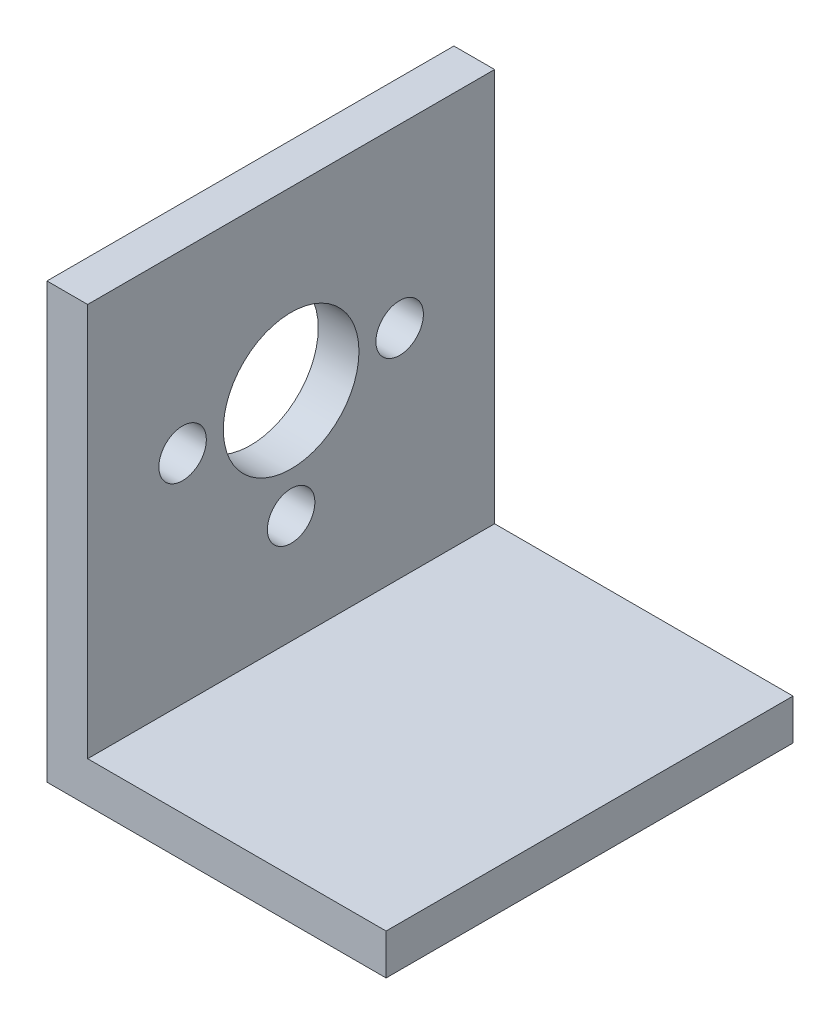
ISO-10303-21;
HEADER;
FILE_DESCRIPTION(('STEP AP214'),'2;1');
FILE_NAME('part.step','',(''),(''),'','','');
FILE_SCHEMA(('AUTOMOTIVE_DESIGN { 1 0 10303 214 1 1 1 1 }'));
ENDSEC;
DATA;
#1=APPLICATION_CONTEXT('core data for automotive mechanical design processes');
#2=APPLICATION_PROTOCOL_DEFINITION('international standard','automotive_design',2000,#1);
#3=PRODUCT_CONTEXT('',#1,'mechanical');
#4=PRODUCT('Part','Part','',(#3));
#5=PRODUCT_RELATED_PRODUCT_CATEGORY('part','',(#4));
#6=PRODUCT_DEFINITION_FORMATION('','',#4);
#7=PRODUCT_DEFINITION_CONTEXT('part definition',#1,'design');
#8=PRODUCT_DEFINITION('design','',#6,#7);
#9=PRODUCT_DEFINITION_SHAPE('','',#8);
#10=(LENGTH_UNIT() NAMED_UNIT(*) SI_UNIT(.MILLI.,.METRE.));
#11=(NAMED_UNIT(*) PLANE_ANGLE_UNIT() SI_UNIT($,.RADIAN.));
#12=(NAMED_UNIT(*) SI_UNIT($,.STERADIAN.) SOLID_ANGLE_UNIT());
#13=UNCERTAINTY_MEASURE_WITH_UNIT(LENGTH_MEASURE(1.E-05),#10,'distance_accuracy_value','');
#14=(GEOMETRIC_REPRESENTATION_CONTEXT(3) GLOBAL_UNCERTAINTY_ASSIGNED_CONTEXT((#13)) GLOBAL_UNIT_ASSIGNED_CONTEXT((#10,
#11,#12)) REPRESENTATION_CONTEXT('',''));
#15=CARTESIAN_POINT('',(0.,0.,0.));
#16=DIRECTION('',(0.,0.,1.));
#17=DIRECTION('',(1.,0.,0.));
#18=AXIS2_PLACEMENT_3D('',#15,#16,#17);
#19=CARTESIAN_POINT('',(-10.8974850351584,31.3475628083256,30.));
#20=DIRECTION('',(0.,-1.,0.));
#21=DIRECTION('',(0.,0.,-1.));
#22=AXIS2_PLACEMENT_3D('',#19,#20,#21);
#23=PLANE('',#22);
#24=DIRECTION('',(-1.,0.,0.));
#25=VECTOR('',#24,1.);
#26=CARTESIAN_POINT('',(-10.8974850351584,31.3475628083256,0.));
#27=LINE('',#26,#25);
#28=CARTESIAN_POINT('',(-7.89748503515838,31.3475628083256,0.));
#29=VERTEX_POINT('',#28);
#30=CARTESIAN_POINT('',(-10.8974850351584,31.3475628083256,0.));
#31=VERTEX_POINT('',#30);
#32=EDGE_CURVE('E116',#29,#31,#27,.T.);
#33=ORIENTED_EDGE('',*,*,#32,.T.);
#34=DIRECTION('',(0.,0.,-1.));
#35=VECTOR('',#34,1.);
#36=CARTESIAN_POINT('',(-10.8974850351584,31.3475628083256,30.));
#37=LINE('',#36,#35);
#38=CARTESIAN_POINT('',(-10.8974850351584,31.3475628083256,30.));
#39=VERTEX_POINT('',#38);
#40=EDGE_CURVE('E11',#39,#31,#37,.T.);
#41=ORIENTED_EDGE('',*,*,#40,.F.);
#42=DIRECTION('',(-1.,0.,0.));
#43=VECTOR('',#42,1.);
#44=CARTESIAN_POINT('',(-10.8974850351584,31.3475628083256,30.));
#45=LINE('',#44,#43);
#46=CARTESIAN_POINT('',(-7.89748503515838,31.3475628083256,30.));
#47=VERTEX_POINT('',#46);
#48=EDGE_CURVE('E127',#47,#39,#45,.T.);
#49=ORIENTED_EDGE('',*,*,#48,.F.);
#50=DIRECTION('',(0.,0.,-1.));
#51=VECTOR('',#50,1.);
#52=CARTESIAN_POINT('',(-7.89748503515838,31.3475628083256,30.));
#53=LINE('',#52,#51);
#54=EDGE_CURVE('E112',#47,#29,#53,.T.);
#55=ORIENTED_EDGE('',*,*,#54,.T.);
#56=EDGE_LOOP('',(#33,#41,#49,#55));
#57=FACE_BOUND('',#56,.T.);
#58=ADVANCED_FACE('F32',(#57),#23,.F.);
#59=CARTESIAN_POINT('',(-10.8974850351584,-0.652437191674368,30.));
#60=DIRECTION('',(1.,0.,0.));
#61=DIRECTION('',(0.,0.,-1.));
#62=AXIS2_PLACEMENT_3D('',#59,#60,#61);
#63=PLANE('',#62);
#64=CARTESIAN_POINT('',(-10.8974850351584,18.3475628083256,7.));
#65=DIRECTION('',(1.,0.,0.));
#66=DIRECTION('',(0.,0.,-1.));
#67=AXIS2_PLACEMENT_3D('',#64,#65,#66);
#68=CIRCLE('',#67,1.75);
#69=CARTESIAN_POINT('',(-10.8974850351584,18.3475628083256,5.25));
#70=VERTEX_POINT('',#69);
#71=EDGE_CURVE('E244',#70,#70,#68,.T.);
#72=ORIENTED_EDGE('',*,*,#71,.T.);
#73=EDGE_LOOP('',(#72));
#74=FACE_BOUND('',#73,.T.);
#75=CARTESIAN_POINT('',(-10.8974850351584,18.3475628083256,23.));
#76=DIRECTION('',(1.,0.,0.));
#77=DIRECTION('',(0.,0.,-1.));
#78=AXIS2_PLACEMENT_3D('',#75,#76,#77);
#79=CIRCLE('',#78,1.75);
#80=CARTESIAN_POINT('',(-10.8974850351584,18.3475628083256,21.25));
#81=VERTEX_POINT('',#80);
#82=EDGE_CURVE('E253',#81,#81,#79,.T.);
#83=ORIENTED_EDGE('',*,*,#82,.T.);
#84=EDGE_LOOP('',(#83));
#85=FACE_BOUND('',#84,.T.);
#86=CARTESIAN_POINT('',(-10.8974850351584,10.3475628083256,15.));
#87=DIRECTION('',(1.,0.,0.));
#88=DIRECTION('',(0.,0.,-1.));
#89=AXIS2_PLACEMENT_3D('',#86,#87,#88);
#90=CIRCLE('',#89,1.75);
#91=CARTESIAN_POINT('',(-10.8974850351584,10.3475628083256,13.25));
#92=VERTEX_POINT('',#91);
#93=EDGE_CURVE('E259',#92,#92,#90,.T.);
#94=ORIENTED_EDGE('',*,*,#93,.T.);
#95=EDGE_LOOP('',(#94));
#96=FACE_BOUND('',#95,.T.);
#97=CARTESIAN_POINT('',(-10.8974850351584,18.3475628083256,15.));
#98=DIRECTION('',(1.,0.,0.));
#99=DIRECTION('',(0.,0.,-1.));
#100=AXIS2_PLACEMENT_3D('',#97,#98,#99);
#101=CIRCLE('',#100,5.);
#102=CARTESIAN_POINT('',(-10.8974850351584,18.3475628083256,10.));
#103=VERTEX_POINT('',#102);
#104=EDGE_CURVE('E120',#103,#103,#101,.T.);
#105=ORIENTED_EDGE('',*,*,#104,.T.);
#106=EDGE_LOOP('',(#105));
#107=FACE_BOUND('',#106,.T.);
#108=DIRECTION('',(0.,-1.,0.));
#109=VECTOR('',#108,1.);
#110=CARTESIAN_POINT('',(-10.8974850351584,-0.652437191674368,0.));
#111=LINE('',#110,#109);
#112=CARTESIAN_POINT('',(-10.8974850351584,-0.652437191674368,0.));
#113=VERTEX_POINT('',#112);
#114=EDGE_CURVE('E119',#31,#113,#111,.T.);
#115=ORIENTED_EDGE('',*,*,#114,.T.);
#116=DIRECTION('',(0.,0.,-1.));
#117=VECTOR('',#116,1.);
#118=CARTESIAN_POINT('',(-10.8974850351584,-0.652437191674368,30.));
#119=LINE('',#118,#117);
#120=CARTESIAN_POINT('',(-10.8974850351584,-0.652437191674368,30.));
#121=VERTEX_POINT('',#120);
#122=EDGE_CURVE('E40',#121,#113,#119,.T.);
#123=ORIENTED_EDGE('',*,*,#122,.F.);
#124=DIRECTION('',(0.,-1.,0.));
#125=VECTOR('',#124,1.);
#126=CARTESIAN_POINT('',(-10.8974850351584,-0.652437191674368,30.));
#127=LINE('',#126,#125);
#128=EDGE_CURVE('E85',#39,#121,#127,.T.);
#129=ORIENTED_EDGE('',*,*,#128,.F.);
#130=ORIENTED_EDGE('',*,*,#40,.T.);
#131=EDGE_LOOP('',(#115,#123,#129,#130));
#132=FACE_BOUND('',#131,.T.);
#133=ADVANCED_FACE('F154',(#74,#85,#96,#107,#132),#63,.F.);
#134=CARTESIAN_POINT('',(14.1025149648416,-0.652437191674365,30.));
#135=DIRECTION('',(0.,1.,0.));
#136=DIRECTION('',(-1.,0.,0.));
#137=AXIS2_PLACEMENT_3D('',#134,#135,#136);
#138=PLANE('',#137);
#139=DIRECTION('',(1.,0.,0.));
#140=VECTOR('',#139,1.);
#141=CARTESIAN_POINT('',(14.1025149648416,-0.652437191674365,0.));
#142=LINE('',#141,#140);
#143=CARTESIAN_POINT('',(14.1025149648416,-0.652437191674365,0.));
#144=VERTEX_POINT('',#143);
#145=EDGE_CURVE('E122',#113,#144,#142,.T.);
#146=ORIENTED_EDGE('',*,*,#145,.T.);
#147=DIRECTION('',(0.,0.,-1.));
#148=VECTOR('',#147,1.);
#149=CARTESIAN_POINT('',(14.1025149648416,-0.652437191674365,30.));
#150=LINE('',#149,#148);
#151=CARTESIAN_POINT('',(14.1025149648416,-0.652437191674365,30.));
#152=VERTEX_POINT('',#151);
#153=EDGE_CURVE('E107',#152,#144,#150,.T.);
#154=ORIENTED_EDGE('',*,*,#153,.F.);
#155=DIRECTION('',(1.,0.,0.));
#156=VECTOR('',#155,1.);
#157=CARTESIAN_POINT('',(14.1025149648416,-0.652437191674365,30.));
#158=LINE('',#157,#156);
#159=EDGE_CURVE('E98',#121,#152,#158,.T.);
#160=ORIENTED_EDGE('',*,*,#159,.F.);
#161=ORIENTED_EDGE('',*,*,#122,.T.);
#162=EDGE_LOOP('',(#146,#154,#160,#161));
#163=FACE_BOUND('',#162,.T.);
#164=ADVANCED_FACE('F133',(#163),#138,.F.);
#165=CARTESIAN_POINT('',(14.1025149648416,2.34756280832563,30.));
#166=DIRECTION('',(-1.,0.,0.));
#167=DIRECTION('',(0.,-1.,0.));
#168=AXIS2_PLACEMENT_3D('',#165,#166,#167);
#169=PLANE('',#168);
#170=DIRECTION('',(0.,1.,0.));
#171=VECTOR('',#170,1.);
#172=CARTESIAN_POINT('',(14.1025149648416,2.34756280832563,0.));
#173=LINE('',#172,#171);
#174=CARTESIAN_POINT('',(14.1025149648416,2.34756280832563,0.));
#175=VERTEX_POINT('',#174);
#176=EDGE_CURVE('E106',#144,#175,#173,.T.);
#177=ORIENTED_EDGE('',*,*,#176,.T.);
#178=DIRECTION('',(0.,0.,-1.));
#179=VECTOR('',#178,1.);
#180=CARTESIAN_POINT('',(14.1025149648416,2.34756280832563,30.));
#181=LINE('',#180,#179);
#182=CARTESIAN_POINT('',(14.1025149648416,2.34756280832563,30.));
#183=VERTEX_POINT('',#182);
#184=EDGE_CURVE('E103',#183,#175,#181,.T.);
#185=ORIENTED_EDGE('',*,*,#184,.F.);
#186=DIRECTION('',(0.,1.,0.));
#187=VECTOR('',#186,1.);
#188=CARTESIAN_POINT('',(14.1025149648416,2.34756280832563,30.));
#189=LINE('',#188,#187);
#190=EDGE_CURVE('E92',#152,#183,#189,.T.);
#191=ORIENTED_EDGE('',*,*,#190,.F.);
#192=ORIENTED_EDGE('',*,*,#153,.T.);
#193=EDGE_LOOP('',(#177,#185,#191,#192));
#194=FACE_BOUND('',#193,.T.);
#195=ADVANCED_FACE('F104',(#194),#169,.F.);
#196=CARTESIAN_POINT('',(-7.89748503515838,2.34756280832563,30.));
#197=DIRECTION('',(0.,-1.,0.));
#198=DIRECTION('',(1.,0.,0.));
#199=AXIS2_PLACEMENT_3D('',#196,#197,#198);
#200=PLANE('',#199);
#201=DIRECTION('',(-1.,0.,0.));
#202=VECTOR('',#201,1.);
#203=CARTESIAN_POINT('',(-7.89748503515838,2.34756280832563,0.));
#204=LINE('',#203,#202);
#205=CARTESIAN_POINT('',(-7.89748503515838,2.34756280832563,0.));
#206=VERTEX_POINT('',#205);
#207=EDGE_CURVE('E71',#175,#206,#204,.T.);
#208=ORIENTED_EDGE('',*,*,#207,.T.);
#209=DIRECTION('',(0.,0.,-1.));
#210=VECTOR('',#209,1.);
#211=CARTESIAN_POINT('',(-7.89748503515838,2.34756280832563,30.));
#212=LINE('',#211,#210);
#213=CARTESIAN_POINT('',(-7.89748503515838,2.34756280832563,30.));
#214=VERTEX_POINT('',#213);
#215=EDGE_CURVE('E108',#214,#206,#212,.T.);
#216=ORIENTED_EDGE('',*,*,#215,.F.);
#217=DIRECTION('',(-1.,0.,0.));
#218=VECTOR('',#217,1.);
#219=CARTESIAN_POINT('',(-7.89748503515838,2.34756280832563,30.));
#220=LINE('',#219,#218);
#221=EDGE_CURVE('E96',#183,#214,#220,.T.);
#222=ORIENTED_EDGE('',*,*,#221,.F.);
#223=ORIENTED_EDGE('',*,*,#184,.T.);
#224=EDGE_LOOP('',(#208,#216,#222,#223));
#225=FACE_BOUND('',#224,.T.);
#226=ADVANCED_FACE('F110',(#225),#200,.F.);
#227=CARTESIAN_POINT('',(-7.89748503515838,31.3475628083256,30.));
#228=DIRECTION('',(-1.,0.,0.));
#229=DIRECTION('',(0.,0.,1.));
#230=AXIS2_PLACEMENT_3D('',#227,#228,#229);
#231=PLANE('',#230);
#232=CARTESIAN_POINT('',(-7.89748503515838,18.3475628083256,7.));
#233=DIRECTION('',(1.,0.,0.));
#234=DIRECTION('',(0.,0.,-1.));
#235=AXIS2_PLACEMENT_3D('',#232,#233,#234);
#236=CIRCLE('',#235,1.75);
#237=CARTESIAN_POINT('',(-7.89748503515838,18.3475628083256,5.25));
#238=VERTEX_POINT('',#237);
#239=EDGE_CURVE('E246',#238,#238,#236,.T.);
#240=ORIENTED_EDGE('',*,*,#239,.F.);
#241=EDGE_LOOP('',(#240));
#242=FACE_BOUND('',#241,.T.);
#243=CARTESIAN_POINT('',(-7.89748503515838,18.3475628083256,23.));
#244=DIRECTION('',(1.,0.,0.));
#245=DIRECTION('',(0.,0.,-1.));
#246=AXIS2_PLACEMENT_3D('',#243,#244,#245);
#247=CIRCLE('',#246,1.75);
#248=CARTESIAN_POINT('',(-7.89748503515838,18.3475628083256,21.25));
#249=VERTEX_POINT('',#248);
#250=EDGE_CURVE('E248',#249,#249,#247,.T.);
#251=ORIENTED_EDGE('',*,*,#250,.F.);
#252=EDGE_LOOP('',(#251));
#253=FACE_BOUND('',#252,.T.);
#254=CARTESIAN_POINT('',(-7.89748503515838,10.3475628083256,15.));
#255=DIRECTION('',(1.,0.,0.));
#256=DIRECTION('',(0.,0.,-1.));
#257=AXIS2_PLACEMENT_3D('',#254,#255,#256);
#258=CIRCLE('',#257,1.75);
#259=CARTESIAN_POINT('',(-7.89748503515838,10.3475628083256,13.25));
#260=VERTEX_POINT('',#259);
#261=EDGE_CURVE('E256',#260,#260,#258,.T.);
#262=ORIENTED_EDGE('',*,*,#261,.F.);
#263=EDGE_LOOP('',(#262));
#264=FACE_BOUND('',#263,.T.);
#265=CARTESIAN_POINT('',(-7.89748503515838,18.3475628083256,15.));
#266=DIRECTION('',(1.,0.,0.));
#267=DIRECTION('',(0.,0.,-1.));
#268=AXIS2_PLACEMENT_3D('',#265,#266,#267);
#269=CIRCLE('',#268,5.);
#270=CARTESIAN_POINT('',(-7.89748503515838,18.3475628083256,10.));
#271=VERTEX_POINT('',#270);
#272=EDGE_CURVE('E262',#271,#271,#269,.T.);
#273=ORIENTED_EDGE('',*,*,#272,.F.);
#274=EDGE_LOOP('',(#273));
#275=FACE_BOUND('',#274,.T.);
#276=DIRECTION('',(0.,1.,0.));
#277=VECTOR('',#276,1.);
#278=CARTESIAN_POINT('',(-7.89748503515838,31.3475628083256,0.));
#279=LINE('',#278,#277);
#280=EDGE_CURVE('E77',#206,#29,#279,.T.);
#281=ORIENTED_EDGE('',*,*,#280,.T.);
#282=ORIENTED_EDGE('',*,*,#54,.F.);
#283=DIRECTION('',(0.,1.,0.));
#284=VECTOR('',#283,1.);
#285=CARTESIAN_POINT('',(-7.89748503515838,31.3475628083256,30.));
#286=LINE('',#285,#284);
#287=EDGE_CURVE('E48',#214,#47,#286,.T.);
#288=ORIENTED_EDGE('',*,*,#287,.F.);
#289=ORIENTED_EDGE('',*,*,#215,.T.);
#290=EDGE_LOOP('',(#281,#282,#288,#289));
#291=FACE_BOUND('',#290,.T.);
#292=ADVANCED_FACE('F140',(#242,#253,#264,#275,#291),#231,.F.);
#293=CARTESIAN_POINT('',(0.,0.,30.));
#294=DIRECTION('',(0.,0.,-1.));
#295=DIRECTION('',(-1.,0.,0.));
#296=AXIS2_PLACEMENT_3D('',#293,#294,#295);
#297=PLANE('',#296);
#298=ORIENTED_EDGE('',*,*,#48,.T.);
#299=ORIENTED_EDGE('',*,*,#128,.T.);
#300=ORIENTED_EDGE('',*,*,#159,.T.);
#301=ORIENTED_EDGE('',*,*,#190,.T.);
#302=ORIENTED_EDGE('',*,*,#221,.T.);
#303=ORIENTED_EDGE('',*,*,#287,.T.);
#304=EDGE_LOOP('',(#298,#299,#300,#301,#302,#303));
#305=FACE_BOUND('',#304,.T.);
#306=ADVANCED_FACE('F94',(#305),#297,.F.);
#307=CARTESIAN_POINT('',(0.,0.,0.));
#308=DIRECTION('',(0.,0.,-1.));
#309=DIRECTION('',(-1.,0.,0.));
#310=AXIS2_PLACEMENT_3D('',#307,#308,#309);
#311=PLANE('',#310);
#312=ORIENTED_EDGE('',*,*,#32,.F.);
#313=ORIENTED_EDGE('',*,*,#280,.F.);
#314=ORIENTED_EDGE('',*,*,#207,.F.);
#315=ORIENTED_EDGE('',*,*,#176,.F.);
#316=ORIENTED_EDGE('',*,*,#145,.F.);
#317=ORIENTED_EDGE('',*,*,#114,.F.);
#318=EDGE_LOOP('',(#312,#313,#314,#315,#316,#317));
#319=FACE_BOUND('',#318,.T.);
#320=ADVANCED_FACE('F136',(#319),#311,.T.);
#321=CARTESIAN_POINT('',(-7.89748503515838,18.3475628083256,15.));
#322=DIRECTION('',(1.,0.,0.));
#323=DIRECTION('',(0.,0.,-1.));
#324=AXIS2_PLACEMENT_3D('',#321,#322,#323);
#325=CYLINDRICAL_SURFACE('',#324,5.);
#326=ORIENTED_EDGE('',*,*,#104,.F.);
#327=EDGE_LOOP('',(#326));
#328=FACE_BOUND('',#327,.T.);
#329=ORIENTED_EDGE('',*,*,#272,.T.);
#330=EDGE_LOOP('',(#329));
#331=FACE_BOUND('',#330,.T.);
#332=ADVANCED_FACE('F191',(#328,#331),#325,.F.);
#333=CARTESIAN_POINT('',(-7.89748503515838,10.3475628083256,15.));
#334=DIRECTION('',(1.,0.,0.));
#335=DIRECTION('',(0.,0.,-1.));
#336=AXIS2_PLACEMENT_3D('',#333,#334,#335);
#337=CYLINDRICAL_SURFACE('',#336,1.75);
#338=ORIENTED_EDGE('',*,*,#93,.F.);
#339=EDGE_LOOP('',(#338));
#340=FACE_BOUND('',#339,.T.);
#341=ORIENTED_EDGE('',*,*,#261,.T.);
#342=EDGE_LOOP('',(#341));
#343=FACE_BOUND('',#342,.T.);
#344=ADVANCED_FACE('F198',(#340,#343),#337,.F.);
#345=CARTESIAN_POINT('',(-7.89748503515838,18.3475628083256,23.));
#346=DIRECTION('',(1.,0.,0.));
#347=DIRECTION('',(0.,0.,-1.));
#348=AXIS2_PLACEMENT_3D('',#345,#346,#347);
#349=CYLINDRICAL_SURFACE('',#348,1.75);
#350=ORIENTED_EDGE('',*,*,#82,.F.);
#351=EDGE_LOOP('',(#350));
#352=FACE_BOUND('',#351,.T.);
#353=ORIENTED_EDGE('',*,*,#250,.T.);
#354=EDGE_LOOP('',(#353));
#355=FACE_BOUND('',#354,.T.);
#356=ADVANCED_FACE('F218',(#352,#355),#349,.F.);
#357=CARTESIAN_POINT('',(-7.89748503515838,18.3475628083256,7.));
#358=DIRECTION('',(1.,0.,0.));
#359=DIRECTION('',(0.,0.,-1.));
#360=AXIS2_PLACEMENT_3D('',#357,#358,#359);
#361=CYLINDRICAL_SURFACE('',#360,1.75);
#362=ORIENTED_EDGE('',*,*,#71,.F.);
#363=EDGE_LOOP('',(#362));
#364=FACE_BOUND('',#363,.T.);
#365=ORIENTED_EDGE('',*,*,#239,.T.);
#366=EDGE_LOOP('',(#365));
#367=FACE_BOUND('',#366,.T.);
#368=ADVANCED_FACE('F228',(#364,#367),#361,.F.);
#369=CLOSED_SHELL('',(#58,#133,#164,#195,#226,#292,#306,#320,#332,#344,#356,#368));
#370=MANIFOLD_SOLID_BREP('B2',#369);
#371=ADVANCED_BREP_SHAPE_REPRESENTATION('',(#18,#370),#14);
#372=SHAPE_DEFINITION_REPRESENTATION(#9,#371);
ENDSEC;
END-ISO-10303-21;
